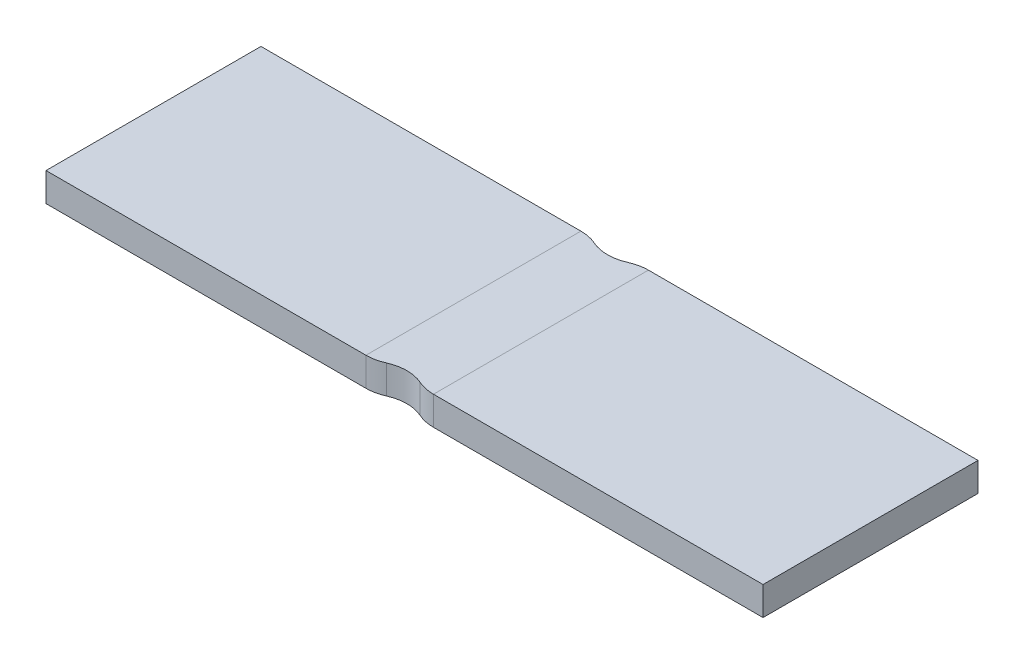
ISO-10303-21;
HEADER;
FILE_DESCRIPTION(('STEP AP214'),'2;1');
FILE_NAME('part.step','',(''),(''),'','','');
FILE_SCHEMA(('AUTOMOTIVE_DESIGN { 1 0 10303 214 1 1 1 1 }'));
ENDSEC;
DATA;
#1=APPLICATION_CONTEXT('core data for automotive mechanical design processes');
#2=APPLICATION_PROTOCOL_DEFINITION('international standard','automotive_design',2000,#1);
#3=PRODUCT_CONTEXT('',#1,'mechanical');
#4=PRODUCT('Part','Part','',(#3));
#5=PRODUCT_RELATED_PRODUCT_CATEGORY('part','',(#4));
#6=PRODUCT_DEFINITION_FORMATION('','',#4);
#7=PRODUCT_DEFINITION_CONTEXT('part definition',#1,'design');
#8=PRODUCT_DEFINITION('design','',#6,#7);
#9=PRODUCT_DEFINITION_SHAPE('','',#8);
#10=(LENGTH_UNIT() NAMED_UNIT(*) SI_UNIT(.MILLI.,.METRE.));
#11=(NAMED_UNIT(*) PLANE_ANGLE_UNIT() SI_UNIT($,.RADIAN.));
#12=(NAMED_UNIT(*) SI_UNIT($,.STERADIAN.) SOLID_ANGLE_UNIT());
#13=UNCERTAINTY_MEASURE_WITH_UNIT(LENGTH_MEASURE(1.E-05),#10,'distance_accuracy_value','');
#14=(GEOMETRIC_REPRESENTATION_CONTEXT(3) GLOBAL_UNCERTAINTY_ASSIGNED_CONTEXT((#13)) GLOBAL_UNIT_ASSIGNED_CONTEXT((#10,
#11,#12)) REPRESENTATION_CONTEXT('',''));
#15=CARTESIAN_POINT('',(0.,0.,0.));
#16=DIRECTION('',(0.,0.,1.));
#17=DIRECTION('',(1.,0.,0.));
#18=AXIS2_PLACEMENT_3D('',#15,#16,#17);
#19=CARTESIAN_POINT('',(-2.57522203923062,8.,0.));
#20=DIRECTION('',(0.,0.,-1.));
#21=DIRECTION('',(0.,1.,0.));
#22=AXIS2_PLACEMENT_3D('',#19,#20,#21);
#23=PLANE('',#22);
#24=DIRECTION('',(1.,0.,0.));
#25=VECTOR('',#24,1.);
#26=CARTESIAN_POINT('',(-6.57522203923062,0.,0.));
#27=LINE('',#26,#25);
#28=CARTESIAN_POINT('',(1.42477796076938,0.,0.));
#29=VERTEX_POINT('',#28);
#30=CARTESIAN_POINT('',(47.4180793812148,0.,0.));
#31=VERTEX_POINT('',#30);
#32=EDGE_CURVE('E175',#29,#31,#27,.T.);
#33=ORIENTED_EDGE('',*,*,#32,.F.);
#34=DIRECTION('',(0.,1.,0.));
#35=VECTOR('',#34,1.);
#36=CARTESIAN_POINT('',(1.42477796076938,0.,0.));
#37=LINE('',#36,#35);
#38=CARTESIAN_POINT('',(1.42477796076938,4.,0.));
#39=VERTEX_POINT('',#38);
#40=EDGE_CURVE('E229',#29,#39,#37,.T.);
#41=ORIENTED_EDGE('',*,*,#40,.T.);
#42=DIRECTION('',(1.,0.,0.));
#43=VECTOR('',#42,1.);
#44=CARTESIAN_POINT('',(-6.57522203923062,4.,0.));
#45=LINE('',#44,#43);
#46=CARTESIAN_POINT('',(47.4180793812148,4.,0.));
#47=VERTEX_POINT('',#46);
#48=EDGE_CURVE('E209',#39,#47,#45,.T.);
#49=ORIENTED_EDGE('',*,*,#48,.T.);
#50=DIRECTION('',(0.,-1.,0.));
#51=VECTOR('',#50,1.);
#52=CARTESIAN_POINT('',(47.4180793812148,4.,0.));
#53=LINE('',#52,#51);
#54=EDGE_CURVE('E218',#47,#31,#53,.T.);
#55=ORIENTED_EDGE('',*,*,#54,.T.);
#56=EDGE_LOOP('',(#33,#41,#49,#55));
#57=FACE_BOUND('',#56,.T.);
#58=ADVANCED_FACE('F35',(#57),#23,.T.);
#59=CARTESIAN_POINT('',(-6.57522203923062,0.,30.));
#60=DIRECTION('',(0.,1.,0.));
#61=DIRECTION('',(0.,0.,1.));
#62=AXIS2_PLACEMENT_3D('',#59,#60,#61);
#63=PLANE('',#62);
#64=ORIENTED_EDGE('',*,*,#32,.T.);
#65=DIRECTION('',(0.,0.,-1.));
#66=VECTOR('',#65,1.);
#67=CARTESIAN_POINT('',(47.4180793812148,0.,30.));
#68=LINE('',#67,#66);
#69=CARTESIAN_POINT('',(47.4180793812148,0.,30.));
#70=VERTEX_POINT('',#69);
#71=EDGE_CURVE('E224',#70,#31,#68,.T.);
#72=ORIENTED_EDGE('',*,*,#71,.F.);
#73=DIRECTION('',(1.,0.,0.));
#74=VECTOR('',#73,1.);
#75=CARTESIAN_POINT('',(-6.57522203923062,0.,30.));
#76=LINE('',#75,#74);
#77=CARTESIAN_POINT('',(1.42477796076938,0.,30.));
#78=VERTEX_POINT('',#77);
#79=EDGE_CURVE('E206',#78,#70,#76,.T.);
#80=ORIENTED_EDGE('',*,*,#79,.F.);
#81=DIRECTION('',(0.,0.,-1.));
#82=VECTOR('',#81,1.);
#83=CARTESIAN_POINT('',(1.42477796076938,0.,30.));
#84=LINE('',#83,#82);
#85=EDGE_CURVE('E42',#78,#29,#84,.T.);
#86=ORIENTED_EDGE('',*,*,#85,.T.);
#87=EDGE_LOOP('',(#64,#72,#80,#86));
#88=FACE_BOUND('',#87,.T.);
#89=ADVANCED_FACE('F232',(#88),#63,.F.);
#90=CARTESIAN_POINT('',(47.4180793812148,4.,30.));
#91=DIRECTION('',(1.,0.,0.));
#92=DIRECTION('',(0.,0.,1.));
#93=AXIS2_PLACEMENT_3D('',#90,#91,#92);
#94=PLANE('',#93);
#95=ORIENTED_EDGE('',*,*,#54,.F.);
#96=DIRECTION('',(0.,0.,-1.));
#97=VECTOR('',#96,1.);
#98=CARTESIAN_POINT('',(47.4180793812148,4.,30.));
#99=LINE('',#98,#97);
#100=CARTESIAN_POINT('',(47.4180793812148,4.,30.));
#101=VERTEX_POINT('',#100);
#102=EDGE_CURVE('E215',#101,#47,#99,.T.);
#103=ORIENTED_EDGE('',*,*,#102,.F.);
#104=DIRECTION('',(0.,-1.,0.));
#105=VECTOR('',#104,1.);
#106=CARTESIAN_POINT('',(47.4180793812148,4.,30.));
#107=LINE('',#106,#105);
#108=EDGE_CURVE('E208',#101,#70,#107,.T.);
#109=ORIENTED_EDGE('',*,*,#108,.T.);
#110=ORIENTED_EDGE('',*,*,#71,.T.);
#111=EDGE_LOOP('',(#95,#103,#109,#110));
#112=FACE_BOUND('',#111,.T.);
#113=ADVANCED_FACE('F287',(#112),#94,.T.);
#114=CARTESIAN_POINT('',(-6.57522203923062,4.,30.));
#115=DIRECTION('',(0.,1.,0.));
#116=DIRECTION('',(0.,0.,1.));
#117=AXIS2_PLACEMENT_3D('',#114,#115,#116);
#118=PLANE('',#117);
#119=ORIENTED_EDGE('',*,*,#48,.F.);
#120=DIRECTION('',(0.,0.,-1.));
#121=VECTOR('',#120,1.);
#122=CARTESIAN_POINT('',(1.42477796076938,4.,30.));
#123=LINE('',#122,#121);
#124=CARTESIAN_POINT('',(1.42477796076938,4.,30.));
#125=VERTEX_POINT('',#124);
#126=EDGE_CURVE('E226',#125,#39,#123,.T.);
#127=ORIENTED_EDGE('',*,*,#126,.F.);
#128=DIRECTION('',(1.,0.,0.));
#129=VECTOR('',#128,1.);
#130=CARTESIAN_POINT('',(-6.57522203923062,4.,30.));
#131=LINE('',#130,#129);
#132=EDGE_CURVE('E212',#125,#101,#131,.T.);
#133=ORIENTED_EDGE('',*,*,#132,.T.);
#134=ORIENTED_EDGE('',*,*,#102,.T.);
#135=EDGE_LOOP('',(#119,#127,#133,#134));
#136=FACE_BOUND('',#135,.T.);
#137=ADVANCED_FACE('F246',(#136),#118,.T.);
#138=CARTESIAN_POINT('',(1.42477796076938,8.,30.));
#139=DIRECTION('',(0.,0.,1.));
#140=DIRECTION('',(0.,-1.,0.));
#141=AXIS2_PLACEMENT_3D('',#138,#139,#140);
#142=PLANE('',#141);
#143=ORIENTED_EDGE('',*,*,#79,.T.);
#144=ORIENTED_EDGE('',*,*,#108,.F.);
#145=ORIENTED_EDGE('',*,*,#132,.F.);
#146=DIRECTION('',(0.,-1.,0.));
#147=VECTOR('',#146,1.);
#148=CARTESIAN_POINT('',(1.42477796076938,4.,30.));
#149=LINE('',#148,#147);
#150=EDGE_CURVE('E11',#125,#78,#149,.T.);
#151=ORIENTED_EDGE('',*,*,#150,.T.);
#152=EDGE_LOOP('',(#143,#144,#145,#151));
#153=FACE_BOUND('',#152,.T.);
#154=ADVANCED_FACE('F238',(#153),#142,.T.);
#155=CARTESIAN_POINT('',(-52.6518190253075,0.,30.));
#156=DIRECTION('',(-1.,0.,0.));
#157=DIRECTION('',(0.,0.,1.));
#158=AXIS2_PLACEMENT_3D('',#155,#156,#157);
#159=PLANE('',#158);
#160=DIRECTION('',(0.,1.,0.));
#161=VECTOR('',#160,1.);
#162=CARTESIAN_POINT('',(-52.6518190253075,0.,0.));
#163=LINE('',#162,#161);
#164=CARTESIAN_POINT('',(-52.6518190253075,0.,0.));
#165=VERTEX_POINT('',#164);
#166=CARTESIAN_POINT('',(-52.6518190253075,4.,0.));
#167=VERTEX_POINT('',#166);
#168=EDGE_CURVE('E184',#165,#167,#163,.T.);
#169=ORIENTED_EDGE('',*,*,#168,.F.);
#170=DIRECTION('',(0.,0.,-1.));
#171=VECTOR('',#170,1.);
#172=CARTESIAN_POINT('',(-52.6518190253075,0.,30.));
#173=LINE('',#172,#171);
#174=CARTESIAN_POINT('',(-52.6518190253075,0.,30.));
#175=VERTEX_POINT('',#174);
#176=EDGE_CURVE('E179',#175,#165,#173,.T.);
#177=ORIENTED_EDGE('',*,*,#176,.F.);
#178=DIRECTION('',(0.,1.,0.));
#179=VECTOR('',#178,1.);
#180=CARTESIAN_POINT('',(-52.6518190253075,0.,30.));
#181=LINE('',#180,#179);
#182=CARTESIAN_POINT('',(-52.6518190253075,4.,30.));
#183=VERTEX_POINT('',#182);
#184=EDGE_CURVE('E201',#175,#183,#181,.T.);
#185=ORIENTED_EDGE('',*,*,#184,.T.);
#186=DIRECTION('',(0.,0.,-1.));
#187=VECTOR('',#186,1.);
#188=CARTESIAN_POINT('',(-52.6518190253075,4.,30.));
#189=LINE('',#188,#187);
#190=EDGE_CURVE('E199',#183,#167,#189,.T.);
#191=ORIENTED_EDGE('',*,*,#190,.T.);
#192=EDGE_LOOP('',(#169,#177,#185,#191));
#193=FACE_BOUND('',#192,.T.);
#194=ADVANCED_FACE('F266',(#193),#159,.T.);
#195=CARTESIAN_POINT('',(-52.6518190253075,4.,30.));
#196=DIRECTION('',(0.,1.,0.));
#197=DIRECTION('',(0.,0.,1.));
#198=AXIS2_PLACEMENT_3D('',#195,#196,#197);
#199=PLANE('',#198);
#200=DIRECTION('',(1.,0.,0.));
#201=VECTOR('',#200,1.);
#202=CARTESIAN_POINT('',(-52.6518190253075,4.,0.));
#203=LINE('',#202,#201);
#204=CARTESIAN_POINT('',(-8.,4.,0.));
#205=VERTEX_POINT('',#204);
#206=EDGE_CURVE('E190',#167,#205,#203,.T.);
#207=ORIENTED_EDGE('',*,*,#206,.F.);
#208=ORIENTED_EDGE('',*,*,#190,.F.);
#209=DIRECTION('',(1.,0.,0.));
#210=VECTOR('',#209,1.);
#211=CARTESIAN_POINT('',(-52.6518190253075,4.,30.));
#212=LINE('',#211,#210);
#213=CARTESIAN_POINT('',(-8.,4.,30.));
#214=VERTEX_POINT('',#213);
#215=EDGE_CURVE('E196',#183,#214,#212,.T.);
#216=ORIENTED_EDGE('',*,*,#215,.T.);
#217=DIRECTION('',(0.,0.,-1.));
#218=VECTOR('',#217,1.);
#219=CARTESIAN_POINT('',(-8.,4.,30.));
#220=LINE('',#219,#218);
#221=EDGE_CURVE('E193',#214,#205,#220,.T.);
#222=ORIENTED_EDGE('',*,*,#221,.T.);
#223=EDGE_LOOP('',(#207,#208,#216,#222));
#224=FACE_BOUND('',#223,.T.);
#225=ADVANCED_FACE('F259',(#224),#199,.T.);
#226=CARTESIAN_POINT('',(-8.,8.,0.));
#227=DIRECTION('',(0.,0.,1.));
#228=DIRECTION('',(1.,0.,0.));
#229=AXIS2_PLACEMENT_3D('',#226,#227,#228);
#230=PLANE('',#229);
#231=ORIENTED_EDGE('',*,*,#206,.T.);
#232=DIRECTION('',(0.,-1.,0.));
#233=VECTOR('',#232,1.);
#234=CARTESIAN_POINT('',(-8.,4.,0.));
#235=LINE('',#234,#233);
#236=CARTESIAN_POINT('',(-8.,0.,0.));
#237=VERTEX_POINT('',#236);
#238=EDGE_CURVE('E187',#205,#237,#235,.T.);
#239=ORIENTED_EDGE('',*,*,#238,.T.);
#240=DIRECTION('',(1.,0.,0.));
#241=VECTOR('',#240,1.);
#242=CARTESIAN_POINT('',(-52.6518190253075,0.,0.));
#243=LINE('',#242,#241);
#244=EDGE_CURVE('E181',#165,#237,#243,.T.);
#245=ORIENTED_EDGE('',*,*,#244,.F.);
#246=ORIENTED_EDGE('',*,*,#168,.T.);
#247=EDGE_LOOP('',(#231,#239,#245,#246));
#248=FACE_BOUND('',#247,.T.);
#249=ADVANCED_FACE('F262',(#248),#230,.F.);
#250=CARTESIAN_POINT('',(-52.6518190253075,0.,30.));
#251=DIRECTION('',(0.,1.,0.));
#252=DIRECTION('',(0.,0.,1.));
#253=AXIS2_PLACEMENT_3D('',#250,#251,#252);
#254=PLANE('',#253);
#255=ORIENTED_EDGE('',*,*,#244,.T.);
#256=DIRECTION('',(0.,0.,-1.));
#257=VECTOR('',#256,1.);
#258=CARTESIAN_POINT('',(-8.,0.,30.));
#259=LINE('',#258,#257);
#260=CARTESIAN_POINT('',(-8.,0.,30.));
#261=VERTEX_POINT('',#260);
#262=EDGE_CURVE('E170',#261,#237,#259,.T.);
#263=ORIENTED_EDGE('',*,*,#262,.F.);
#264=DIRECTION('',(1.,0.,0.));
#265=VECTOR('',#264,1.);
#266=CARTESIAN_POINT('',(-52.6518190253075,0.,30.));
#267=LINE('',#266,#265);
#268=EDGE_CURVE('E176',#175,#261,#267,.T.);
#269=ORIENTED_EDGE('',*,*,#268,.F.);
#270=ORIENTED_EDGE('',*,*,#176,.T.);
#271=EDGE_LOOP('',(#255,#263,#269,#270));
#272=FACE_BOUND('',#271,.T.);
#273=ADVANCED_FACE('F274',(#272),#254,.F.);
#274=CARTESIAN_POINT('',(-4.,8.,30.));
#275=DIRECTION('',(0.,0.,1.));
#276=DIRECTION('',(1.,0.,0.));
#277=AXIS2_PLACEMENT_3D('',#274,#275,#276);
#278=PLANE('',#277);
#279=ORIENTED_EDGE('',*,*,#268,.T.);
#280=DIRECTION('',(0.,1.,0.));
#281=VECTOR('',#280,1.);
#282=CARTESIAN_POINT('',(-8.,0.,30.));
#283=LINE('',#282,#281);
#284=EDGE_CURVE('E172',#261,#214,#283,.T.);
#285=ORIENTED_EDGE('',*,*,#284,.T.);
#286=ORIENTED_EDGE('',*,*,#215,.F.);
#287=ORIENTED_EDGE('',*,*,#184,.F.);
#288=EDGE_LOOP('',(#279,#285,#286,#287));
#289=FACE_BOUND('',#288,.T.);
#290=ADVANCED_FACE('F270',(#289),#278,.T.);
#291=CARTESIAN_POINT('',(-3.28761101961531,4.,15.));
#292=DIRECTION('',(0.,1.,0.));
#293=DIRECTION('',(0.,0.,1.));
#294=AXIS2_PLACEMENT_3D('',#291,#292,#293);
#295=PLANE('',#294);
#296=CARTESIAN_POINT('',(1.42477796076939,4.,24.1983475243872));
#297=DIRECTION('',(0.,-1.,0.));
#298=DIRECTION('',(0.,0.,-1.));
#299=AXIS2_PLACEMENT_3D('',#296,#297,#298);
#300=CIRCLE('',#299,5.80165247561277);
#301=CARTESIAN_POINT('',(-0.931416529422974,4.,29.5));
#302=VERTEX_POINT('',#301);
#303=EDGE_CURVE('E129',#125,#302,#300,.T.);
#304=ORIENTED_EDGE('',*,*,#303,.F.);
#305=ORIENTED_EDGE('',*,*,#126,.T.);
#306=CARTESIAN_POINT('',(1.42477796076938,4.,5.80165247561276));
#307=DIRECTION('',(0.,-1.,0.));
#308=DIRECTION('',(0.,0.,-1.));
#309=AXIS2_PLACEMENT_3D('',#306,#307,#308);
#310=CIRCLE('',#309,5.80165247561276);
#311=CARTESIAN_POINT('',(-0.931416529422969,4.,0.500000000000001));
#312=VERTEX_POINT('',#311);
#313=EDGE_CURVE('E157',#312,#39,#310,.T.);
#314=ORIENTED_EDGE('',*,*,#313,.F.);
#315=CARTESIAN_POINT('',(-3.28761101961531,4.,-4.80165247561276));
#316=DIRECTION('',(0.,1.,0.));
#317=DIRECTION('',(0.,0.,1.));
#318=AXIS2_PLACEMENT_3D('',#315,#316,#317);
#319=CIRCLE('',#318,5.80165247561276);
#320=CARTESIAN_POINT('',(-5.64380550980765,4.,0.5));
#321=VERTEX_POINT('',#320);
#322=EDGE_CURVE('E164',#321,#312,#319,.T.);
#323=ORIENTED_EDGE('',*,*,#322,.F.);
#324=CARTESIAN_POINT('',(-8.,4.,5.80165247561276));
#325=DIRECTION('',(0.,-1.,0.));
#326=DIRECTION('',(0.,0.,-1.));
#327=AXIS2_PLACEMENT_3D('',#324,#325,#326);
#328=CIRCLE('',#327,5.80165247561276);
#329=EDGE_CURVE('E151',#205,#321,#328,.T.);
#330=ORIENTED_EDGE('',*,*,#329,.F.);
#331=ORIENTED_EDGE('',*,*,#221,.F.);
#332=CARTESIAN_POINT('',(-8.00000000000003,4.,24.1983475243872));
#333=DIRECTION('',(0.,-1.,0.));
#334=DIRECTION('',(0.,0.,-1.));
#335=AXIS2_PLACEMENT_3D('',#332,#333,#334);
#336=CIRCLE('',#335,5.80165247561277);
#337=CARTESIAN_POINT('',(-5.64380550980768,4.,29.5));
#338=VERTEX_POINT('',#337);
#339=EDGE_CURVE('E143',#338,#214,#336,.T.);
#340=ORIENTED_EDGE('',*,*,#339,.F.);
#341=CARTESIAN_POINT('',(-3.28761101961533,4.,34.8016524756128));
#342=DIRECTION('',(0.,1.,0.));
#343=DIRECTION('',(0.,0.,1.));
#344=AXIS2_PLACEMENT_3D('',#341,#342,#343);
#345=CIRCLE('',#344,5.80165247561277);
#346=EDGE_CURVE('E145',#302,#338,#345,.T.);
#347=ORIENTED_EDGE('',*,*,#346,.F.);
#348=EDGE_LOOP('',(#304,#305,#314,#323,#330,#331,#340,#347));
#349=FACE_BOUND('',#348,.T.);
#350=ADVANCED_FACE('F241',(#349),#295,.T.);
#351=CARTESIAN_POINT('',(-3.28761101961531,0.,15.));
#352=DIRECTION('',(0.,1.,0.));
#353=DIRECTION('',(0.,0.,1.));
#354=AXIS2_PLACEMENT_3D('',#351,#352,#353);
#355=PLANE('',#354);
#356=ORIENTED_EDGE('',*,*,#85,.F.);
#357=CARTESIAN_POINT('',(1.42477796076939,0.,24.1983475243872));
#358=DIRECTION('',(0.,-1.,0.));
#359=DIRECTION('',(0.,0.,-1.));
#360=AXIS2_PLACEMENT_3D('',#357,#358,#359);
#361=CIRCLE('',#360,5.80165247561277);
#362=CARTESIAN_POINT('',(-0.931416529422974,0.,29.5));
#363=VERTEX_POINT('',#362);
#364=EDGE_CURVE('E126',#78,#363,#361,.T.);
#365=ORIENTED_EDGE('',*,*,#364,.T.);
#366=CARTESIAN_POINT('',(-3.28761101961533,0.,34.8016524756128));
#367=DIRECTION('',(0.,1.,0.));
#368=DIRECTION('',(0.,0.,1.));
#369=AXIS2_PLACEMENT_3D('',#366,#367,#368);
#370=CIRCLE('',#369,5.80165247561277);
#371=CARTESIAN_POINT('',(-5.64380550980768,0.,29.5));
#372=VERTEX_POINT('',#371);
#373=EDGE_CURVE('E136',#363,#372,#370,.T.);
#374=ORIENTED_EDGE('',*,*,#373,.T.);
#375=CARTESIAN_POINT('',(-8.00000000000003,0.,24.1983475243872));
#376=DIRECTION('',(0.,-1.,0.));
#377=DIRECTION('',(0.,0.,-1.));
#378=AXIS2_PLACEMENT_3D('',#375,#376,#377);
#379=CIRCLE('',#378,5.80165247561277);
#380=EDGE_CURVE('E49',#372,#261,#379,.T.);
#381=ORIENTED_EDGE('',*,*,#380,.T.);
#382=ORIENTED_EDGE('',*,*,#262,.T.);
#383=CARTESIAN_POINT('',(-8.,0.,5.80165247561276));
#384=DIRECTION('',(0.,-1.,0.));
#385=DIRECTION('',(0.,0.,-1.));
#386=AXIS2_PLACEMENT_3D('',#383,#384,#385);
#387=CIRCLE('',#386,5.80165247561276);
#388=CARTESIAN_POINT('',(-5.64380550980765,0.,0.5));
#389=VERTEX_POINT('',#388);
#390=EDGE_CURVE('E153',#237,#389,#387,.T.);
#391=ORIENTED_EDGE('',*,*,#390,.T.);
#392=CARTESIAN_POINT('',(-3.28761101961531,0.,-4.80165247561276));
#393=DIRECTION('',(0.,1.,0.));
#394=DIRECTION('',(0.,0.,1.));
#395=AXIS2_PLACEMENT_3D('',#392,#393,#394);
#396=CIRCLE('',#395,5.80165247561276);
#397=CARTESIAN_POINT('',(-0.931416529422969,0.,0.5));
#398=VERTEX_POINT('',#397);
#399=EDGE_CURVE('E156',#389,#398,#396,.T.);
#400=ORIENTED_EDGE('',*,*,#399,.T.);
#401=CARTESIAN_POINT('',(1.42477796076938,0.,5.80165247561276));
#402=DIRECTION('',(0.,-1.,0.));
#403=DIRECTION('',(0.,0.,-1.));
#404=AXIS2_PLACEMENT_3D('',#401,#402,#403);
#405=CIRCLE('',#404,5.80165247561276);
#406=EDGE_CURVE('E57',#398,#29,#405,.T.);
#407=ORIENTED_EDGE('',*,*,#406,.T.);
#408=EDGE_LOOP('',(#356,#365,#374,#381,#382,#391,#400,#407));
#409=FACE_BOUND('',#408,.T.);
#410=ADVANCED_FACE('F140',(#409),#355,.F.);
#411=CARTESIAN_POINT('',(-8.,0.,5.80165247561276));
#412=DIRECTION('',(0.,1.,0.));
#413=DIRECTION('',(0.,0.,1.));
#414=AXIS2_PLACEMENT_3D('',#411,#412,#413);
#415=CYLINDRICAL_SURFACE('',#414,5.80165247561276);
#416=ORIENTED_EDGE('',*,*,#329,.T.);
#417=DIRECTION('',(0.,1.,0.));
#418=VECTOR('',#417,1.);
#419=CARTESIAN_POINT('',(-5.64380550980765,0.,0.5));
#420=LINE('',#419,#418);
#421=EDGE_CURVE('E161',#389,#321,#420,.T.);
#422=ORIENTED_EDGE('',*,*,#421,.F.);
#423=ORIENTED_EDGE('',*,*,#390,.F.);
#424=ORIENTED_EDGE('',*,*,#238,.F.);
#425=EDGE_LOOP('',(#416,#422,#423,#424));
#426=FACE_BOUND('',#425,.T.);
#427=ADVANCED_FACE('F308',(#426),#415,.T.);
#428=CARTESIAN_POINT('',(1.42477796076938,0.,5.80165247561276));
#429=DIRECTION('',(0.,1.,0.));
#430=DIRECTION('',(0.,0.,1.));
#431=AXIS2_PLACEMENT_3D('',#428,#429,#430);
#432=CYLINDRICAL_SURFACE('',#431,5.80165247561276);
#433=ORIENTED_EDGE('',*,*,#313,.T.);
#434=ORIENTED_EDGE('',*,*,#40,.F.);
#435=ORIENTED_EDGE('',*,*,#406,.F.);
#436=DIRECTION('',(0.,1.,0.));
#437=VECTOR('',#436,1.);
#438=CARTESIAN_POINT('',(-0.931416529422969,0.,0.500000000000001));
#439=LINE('',#438,#437);
#440=EDGE_CURVE('E168',#398,#312,#439,.T.);
#441=ORIENTED_EDGE('',*,*,#440,.T.);
#442=EDGE_LOOP('',(#433,#434,#435,#441));
#443=FACE_BOUND('',#442,.T.);
#444=ADVANCED_FACE('F249',(#443),#432,.T.);
#445=CARTESIAN_POINT('',(-3.28761101961531,0.,-4.80165247561276));
#446=DIRECTION('',(0.,1.,0.));
#447=DIRECTION('',(0.,0.,1.));
#448=AXIS2_PLACEMENT_3D('',#445,#446,#447);
#449=CYLINDRICAL_SURFACE('',#448,5.80165247561276);
#450=ORIENTED_EDGE('',*,*,#322,.T.);
#451=ORIENTED_EDGE('',*,*,#440,.F.);
#452=ORIENTED_EDGE('',*,*,#399,.F.);
#453=ORIENTED_EDGE('',*,*,#421,.T.);
#454=EDGE_LOOP('',(#450,#451,#452,#453));
#455=FACE_BOUND('',#454,.T.);
#456=ADVANCED_FACE('F252',(#455),#449,.F.);
#457=CARTESIAN_POINT('',(1.42477796076939,0.,24.1983475243872));
#458=DIRECTION('',(0.,1.,0.));
#459=DIRECTION('',(0.,0.,1.));
#460=AXIS2_PLACEMENT_3D('',#457,#458,#459);
#461=CYLINDRICAL_SURFACE('',#460,5.80165247561277);
#462=ORIENTED_EDGE('',*,*,#303,.T.);
#463=DIRECTION('',(0.,1.,0.));
#464=VECTOR('',#463,1.);
#465=CARTESIAN_POINT('',(-0.931416529422974,0.,29.5));
#466=LINE('',#465,#464);
#467=EDGE_CURVE('E122',#363,#302,#466,.T.);
#468=ORIENTED_EDGE('',*,*,#467,.F.);
#469=ORIENTED_EDGE('',*,*,#364,.F.);
#470=ORIENTED_EDGE('',*,*,#150,.F.);
#471=EDGE_LOOP('',(#462,#468,#469,#470));
#472=FACE_BOUND('',#471,.T.);
#473=ADVANCED_FACE('F124',(#472),#461,.T.);
#474=CARTESIAN_POINT('',(-8.00000000000003,0.,24.1983475243872));
#475=DIRECTION('',(0.,1.,0.));
#476=DIRECTION('',(0.,0.,1.));
#477=AXIS2_PLACEMENT_3D('',#474,#475,#476);
#478=CYLINDRICAL_SURFACE('',#477,5.80165247561277);
#479=ORIENTED_EDGE('',*,*,#339,.T.);
#480=ORIENTED_EDGE('',*,*,#284,.F.);
#481=ORIENTED_EDGE('',*,*,#380,.F.);
#482=DIRECTION('',(0.,1.,0.));
#483=VECTOR('',#482,1.);
#484=CARTESIAN_POINT('',(-5.64380550980768,0.,29.5));
#485=LINE('',#484,#483);
#486=EDGE_CURVE('E133',#372,#338,#485,.T.);
#487=ORIENTED_EDGE('',*,*,#486,.T.);
#488=EDGE_LOOP('',(#479,#480,#481,#487));
#489=FACE_BOUND('',#488,.T.);
#490=ADVANCED_FACE('F272',(#489),#478,.T.);
#491=CARTESIAN_POINT('',(-3.28761101961533,0.,34.8016524756128));
#492=DIRECTION('',(0.,1.,0.));
#493=DIRECTION('',(0.,0.,1.));
#494=AXIS2_PLACEMENT_3D('',#491,#492,#493);
#495=CYLINDRICAL_SURFACE('',#494,5.80165247561277);
#496=ORIENTED_EDGE('',*,*,#346,.T.);
#497=ORIENTED_EDGE('',*,*,#486,.F.);
#498=ORIENTED_EDGE('',*,*,#373,.F.);
#499=ORIENTED_EDGE('',*,*,#467,.T.);
#500=EDGE_LOOP('',(#496,#497,#498,#499));
#501=FACE_BOUND('',#500,.T.);
#502=ADVANCED_FACE('F137',(#501),#495,.F.);
#503=CLOSED_SHELL('',(#58,#89,#113,#137,#154,#194,#225,#249,#273,#290,#350,#410,#427,#444,#456,
#473,#490,#502));
#504=MANIFOLD_SOLID_BREP('B2',#503);
#505=ADVANCED_BREP_SHAPE_REPRESENTATION('',(#18,#504),#14);
#506=SHAPE_DEFINITION_REPRESENTATION(#9,#505);
ENDSEC;
END-ISO-10303-21;
